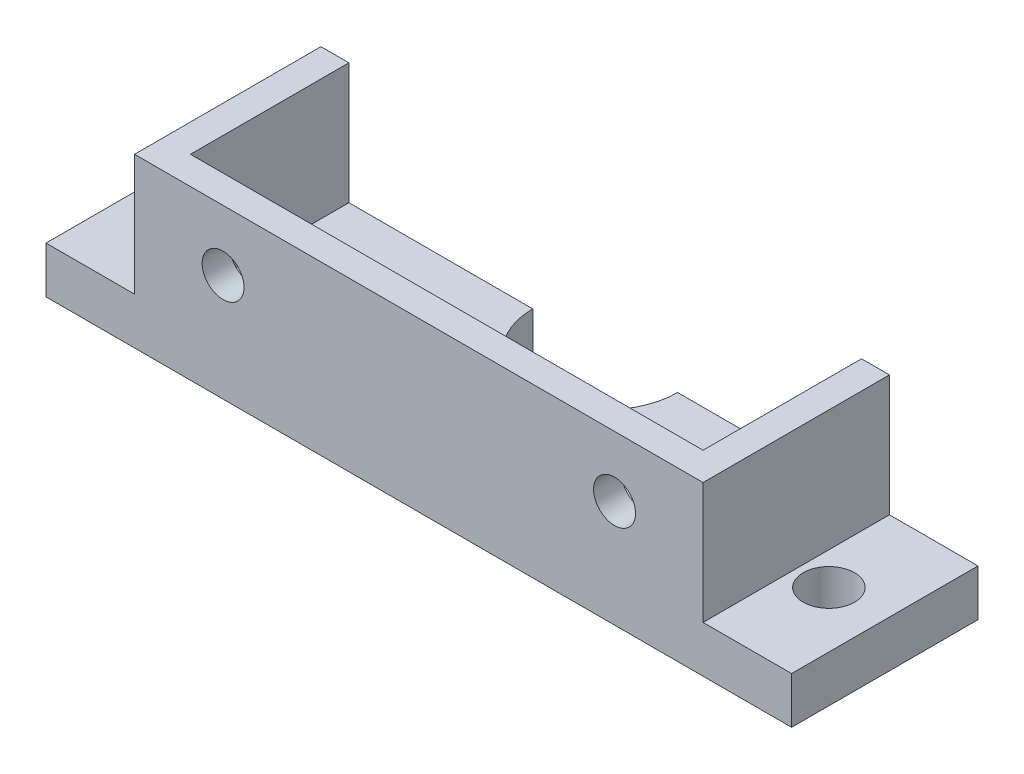
ISO-10303-21;
HEADER;
FILE_DESCRIPTION(('STEP AP214'),'2;1');
FILE_NAME('part.step','',(''),(''),'','','');
FILE_SCHEMA(('AUTOMOTIVE_DESIGN { 1 0 10303 214 1 1 1 1 }'));
ENDSEC;
DATA;
#1=APPLICATION_CONTEXT('core data for automotive mechanical design processes');
#2=APPLICATION_PROTOCOL_DEFINITION('international standard','automotive_design',2000,#1);
#3=PRODUCT_CONTEXT('',#1,'mechanical');
#4=PRODUCT('Part','Part','',(#3));
#5=PRODUCT_RELATED_PRODUCT_CATEGORY('part','',(#4));
#6=PRODUCT_DEFINITION_FORMATION('','',#4);
#7=PRODUCT_DEFINITION_CONTEXT('part definition',#1,'design');
#8=PRODUCT_DEFINITION('design','',#6,#7);
#9=PRODUCT_DEFINITION_SHAPE('','',#8);
#10=(LENGTH_UNIT() NAMED_UNIT(*) SI_UNIT(.MILLI.,.METRE.));
#11=(NAMED_UNIT(*) PLANE_ANGLE_UNIT() SI_UNIT($,.RADIAN.));
#12=(NAMED_UNIT(*) SI_UNIT($,.STERADIAN.) SOLID_ANGLE_UNIT());
#13=UNCERTAINTY_MEASURE_WITH_UNIT(LENGTH_MEASURE(1.E-05),#10,'distance_accuracy_value','');
#14=(GEOMETRIC_REPRESENTATION_CONTEXT(3) GLOBAL_UNCERTAINTY_ASSIGNED_CONTEXT((#13)) GLOBAL_UNIT_ASSIGNED_CONTEXT((#10,
#11,#12)) REPRESENTATION_CONTEXT('',''));
#15=CARTESIAN_POINT('',(0.,0.,0.));
#16=DIRECTION('',(0.,0.,1.));
#17=DIRECTION('',(1.,0.,0.));
#18=AXIS2_PLACEMENT_3D('',#15,#16,#17);
#19=CARTESIAN_POINT('',(-40.,5.,-10.));
#20=DIRECTION('',(0.,0.,1.));
#21=DIRECTION('',(1.,0.,0.));
#22=AXIS2_PLACEMENT_3D('',#19,#20,#21);
#23=PLANE('',#22);
#24=DIRECTION('',(-1.,0.,0.));
#25=VECTOR('',#24,1.);
#26=CARTESIAN_POINT('',(-40.,0.,-10.));
#27=LINE('',#26,#25);
#28=CARTESIAN_POINT('',(40.,0.,-10.));
#29=VERTEX_POINT('',#28);
#30=CARTESIAN_POINT('',(7.77128440844158,0.,-10.));
#31=VERTEX_POINT('',#30);
#32=EDGE_CURVE('E146',#29,#31,#27,.T.);
#33=ORIENTED_EDGE('',*,*,#32,.T.);
#34=DIRECTION('',(0.,1.,0.));
#35=VECTOR('',#34,1.);
#36=CARTESIAN_POINT('',(7.77128440844158,-12.,-10.));
#37=LINE('',#36,#35);
#38=CARTESIAN_POINT('',(7.77128440844158,5.,-10.));
#39=VERTEX_POINT('',#38);
#40=EDGE_CURVE('E48',#31,#39,#37,.T.);
#41=ORIENTED_EDGE('',*,*,#40,.T.);
#42=DIRECTION('',(-1.,0.,0.));
#43=VECTOR('',#42,1.);
#44=CARTESIAN_POINT('',(-40.,5.,-10.));
#45=LINE('',#44,#43);
#46=CARTESIAN_POINT('',(27.5,5.,-10.));
#47=VERTEX_POINT('',#46);
#48=EDGE_CURVE('E144',#47,#39,#45,.T.);
#49=ORIENTED_EDGE('',*,*,#48,.F.);
#50=DIRECTION('',(0.,1.,0.));
#51=VECTOR('',#50,1.);
#52=CARTESIAN_POINT('',(27.5,18.,-10.));
#53=LINE('',#52,#51);
#54=CARTESIAN_POINT('',(27.5,18.,-10.));
#55=VERTEX_POINT('',#54);
#56=EDGE_CURVE('E229',#47,#55,#53,.T.);
#57=ORIENTED_EDGE('',*,*,#56,.T.);
#58=DIRECTION('',(1.,0.,0.));
#59=VECTOR('',#58,1.);
#60=CARTESIAN_POINT('',(30.5,18.,-10.));
#61=LINE('',#60,#59);
#62=CARTESIAN_POINT('',(30.5,18.,-10.));
#63=VERTEX_POINT('',#62);
#64=EDGE_CURVE('E222',#55,#63,#61,.T.);
#65=ORIENTED_EDGE('',*,*,#64,.T.);
#66=DIRECTION('',(0.,-1.,0.));
#67=VECTOR('',#66,1.);
#68=CARTESIAN_POINT('',(30.5,18.,-10.));
#69=LINE('',#68,#67);
#70=CARTESIAN_POINT('',(30.5,5.,-10.));
#71=VERTEX_POINT('',#70);
#72=EDGE_CURVE('E225',#63,#71,#69,.T.);
#73=ORIENTED_EDGE('',*,*,#72,.T.);
#74=CARTESIAN_POINT('',(40.,5.,-10.));
#75=VERTEX_POINT('',#74);
#76=EDGE_CURVE('E153',#75,#71,#45,.T.);
#77=ORIENTED_EDGE('',*,*,#76,.F.);
#78=DIRECTION('',(0.,-1.,0.));
#79=VECTOR('',#78,1.);
#80=CARTESIAN_POINT('',(40.,5.,-10.));
#81=LINE('',#80,#79);
#82=EDGE_CURVE('E41',#75,#29,#81,.T.);
#83=ORIENTED_EDGE('',*,*,#82,.T.);
#84=EDGE_LOOP('',(#33,#41,#49,#57,#65,#73,#77,#83));
#85=FACE_BOUND('',#84,.T.);
#86=ADVANCED_FACE('F33',(#85),#23,.F.);
#87=CARTESIAN_POINT('',(0.,5.,0.));
#88=DIRECTION('',(0.,1.,0.));
#89=DIRECTION('',(0.,0.,1.));
#90=AXIS2_PLACEMENT_3D('',#87,#88,#89);
#91=PLANE('',#90);
#92=CARTESIAN_POINT('',(-34.,5.,0.));
#93=DIRECTION('',(0.,1.,0.));
#94=DIRECTION('',(0.,0.,1.));
#95=AXIS2_PLACEMENT_3D('',#92,#93,#94);
#96=CIRCLE('',#95,2.74999999999999);
#97=CARTESIAN_POINT('',(-34.,5.,2.74999999999999));
#98=VERTEX_POINT('',#97);
#99=EDGE_CURVE('E173',#98,#98,#96,.T.);
#100=ORIENTED_EDGE('',*,*,#99,.F.);
#101=EDGE_LOOP('',(#100));
#102=FACE_BOUND('',#101,.T.);
#103=DIRECTION('',(0.,0.,1.));
#104=VECTOR('',#103,1.);
#105=CARTESIAN_POINT('',(-30.5,5.,7.));
#106=LINE('',#105,#104);
#107=CARTESIAN_POINT('',(-30.5,5.,-10.));
#108=VERTEX_POINT('',#107);
#109=CARTESIAN_POINT('',(-30.5,5.,10.));
#110=VERTEX_POINT('',#109);
#111=EDGE_CURVE('E192',#108,#110,#106,.T.);
#112=ORIENTED_EDGE('',*,*,#111,.F.);
#113=CARTESIAN_POINT('',(-40.,5.,-10.));
#114=VERTEX_POINT('',#113);
#115=EDGE_CURVE('E156',#108,#114,#45,.T.);
#116=ORIENTED_EDGE('',*,*,#115,.T.);
#117=DIRECTION('',(0.,0.,1.));
#118=VECTOR('',#117,1.);
#119=CARTESIAN_POINT('',(-40.,5.,-10.));
#120=LINE('',#119,#118);
#121=CARTESIAN_POINT('',(-40.,5.,10.));
#122=VERTEX_POINT('',#121);
#123=EDGE_CURVE('E158',#114,#122,#120,.T.);
#124=ORIENTED_EDGE('',*,*,#123,.T.);
#125=DIRECTION('',(1.,0.,0.));
#126=VECTOR('',#125,1.);
#127=CARTESIAN_POINT('',(-40.,5.,10.));
#128=LINE('',#127,#126);
#129=EDGE_CURVE('E265',#122,#110,#128,.T.);
#130=ORIENTED_EDGE('',*,*,#129,.T.);
#131=EDGE_LOOP('',(#112,#116,#124,#130));
#132=FACE_BOUND('',#131,.T.);
#133=ADVANCED_FACE('F307',(#102,#132),#91,.T.);
#134=CARTESIAN_POINT('',(0.,5.,-10.));
#135=DIRECTION('',(0.,1.,0.));
#136=DIRECTION('',(0.,0.,1.));
#137=AXIS2_PLACEMENT_3D('',#134,#135,#136);
#138=CIRCLE('',#137,7.77128440844159);
#139=CARTESIAN_POINT('',(-7.7712844084416,5.,-10.));
#140=VERTEX_POINT('',#139);
#141=EDGE_CURVE('E133',#140,#39,#138,.T.);
#142=ORIENTED_EDGE('',*,*,#141,.F.);
#143=CARTESIAN_POINT('',(-27.5,5.,-10.));
#144=VERTEX_POINT('',#143);
#145=EDGE_CURVE('E154',#140,#144,#45,.T.);
#146=ORIENTED_EDGE('',*,*,#145,.T.);
#147=DIRECTION('',(0.,0.,1.));
#148=VECTOR('',#147,1.);
#149=CARTESIAN_POINT('',(-27.5,5.,-10.));
#150=LINE('',#149,#148);
#151=CARTESIAN_POINT('',(-27.5,5.,7.));
#152=VERTEX_POINT('',#151);
#153=EDGE_CURVE('E234',#144,#152,#150,.T.);
#154=ORIENTED_EDGE('',*,*,#153,.T.);
#155=DIRECTION('',(1.,0.,0.));
#156=VECTOR('',#155,1.);
#157=CARTESIAN_POINT('',(-30.5,5.,7.));
#158=LINE('',#157,#156);
#159=CARTESIAN_POINT('',(27.5,5.,7.));
#160=VERTEX_POINT('',#159);
#161=EDGE_CURVE('E190',#152,#160,#158,.T.);
#162=ORIENTED_EDGE('',*,*,#161,.T.);
#163=DIRECTION('',(0.,0.,1.));
#164=VECTOR('',#163,1.);
#165=CARTESIAN_POINT('',(27.5,5.,-10.));
#166=LINE('',#165,#164);
#167=EDGE_CURVE('E152',#47,#160,#166,.T.);
#168=ORIENTED_EDGE('',*,*,#167,.F.);
#169=ORIENTED_EDGE('',*,*,#48,.T.);
#170=EDGE_LOOP('',(#142,#146,#154,#162,#168,#169));
#171=FACE_BOUND('',#170,.T.);
#172=ADVANCED_FACE('F150',(#171),#91,.T.);
#173=CARTESIAN_POINT('',(0.,0.,7.));
#174=DIRECTION('',(0.,0.,1.));
#175=DIRECTION('',(1.,0.,0.));
#176=AXIS2_PLACEMENT_3D('',#173,#174,#175);
#177=PLANE('',#176);
#178=CARTESIAN_POINT('',(21.,11.5,7.));
#179=DIRECTION('',(0.,0.,1.));
#180=DIRECTION('',(1.,0.,0.));
#181=AXIS2_PLACEMENT_3D('',#178,#179,#180);
#182=CIRCLE('',#181,2.25);
#183=CARTESIAN_POINT('',(23.25,11.5,7.));
#184=VERTEX_POINT('',#183);
#185=EDGE_CURVE('E212',#184,#184,#182,.T.);
#186=ORIENTED_EDGE('',*,*,#185,.T.);
#187=EDGE_LOOP('',(#186));
#188=FACE_BOUND('',#187,.T.);
#189=CARTESIAN_POINT('',(-21.,11.5,7.));
#190=DIRECTION('',(0.,0.,1.));
#191=DIRECTION('',(1.,0.,0.));
#192=AXIS2_PLACEMENT_3D('',#189,#190,#191);
#193=CIRCLE('',#192,2.25);
#194=CARTESIAN_POINT('',(-18.75,11.5,7.));
#195=VERTEX_POINT('',#194);
#196=EDGE_CURVE('E206',#195,#195,#193,.T.);
#197=ORIENTED_EDGE('',*,*,#196,.T.);
#198=EDGE_LOOP('',(#197));
#199=FACE_BOUND('',#198,.T.);
#200=DIRECTION('',(0.,-1.,0.));
#201=VECTOR('',#200,1.);
#202=CARTESIAN_POINT('',(-27.5,18.,7.));
#203=LINE('',#202,#201);
#204=CARTESIAN_POINT('',(-27.5,18.,7.));
#205=VERTEX_POINT('',#204);
#206=EDGE_CURVE('E147',#205,#152,#203,.T.);
#207=ORIENTED_EDGE('',*,*,#206,.F.);
#208=DIRECTION('',(-1.,0.,0.));
#209=VECTOR('',#208,1.);
#210=CARTESIAN_POINT('',(-30.5,18.,7.));
#211=LINE('',#210,#209);
#212=CARTESIAN_POINT('',(27.5,18.,7.));
#213=VERTEX_POINT('',#212);
#214=EDGE_CURVE('E199',#213,#205,#211,.T.);
#215=ORIENTED_EDGE('',*,*,#214,.F.);
#216=DIRECTION('',(0.,1.,0.));
#217=VECTOR('',#216,1.);
#218=CARTESIAN_POINT('',(27.5,18.,7.));
#219=LINE('',#218,#217);
#220=EDGE_CURVE('E223',#160,#213,#219,.T.);
#221=ORIENTED_EDGE('',*,*,#220,.F.);
#222=ORIENTED_EDGE('',*,*,#161,.F.);
#223=EDGE_LOOP('',(#207,#215,#221,#222));
#224=FACE_BOUND('',#223,.T.);
#225=ADVANCED_FACE('F299',(#188,#199,#224),#177,.F.);
#226=CARTESIAN_POINT('',(34.,5.,0.));
#227=DIRECTION('',(0.,1.,0.));
#228=DIRECTION('',(0.,0.,1.));
#229=AXIS2_PLACEMENT_3D('',#226,#227,#228);
#230=CIRCLE('',#229,2.75);
#231=CARTESIAN_POINT('',(34.,5.,2.75));
#232=VERTEX_POINT('',#231);
#233=EDGE_CURVE('E181',#232,#232,#230,.T.);
#234=ORIENTED_EDGE('',*,*,#233,.F.);
#235=EDGE_LOOP('',(#234));
#236=FACE_BOUND('',#235,.T.);
#237=ORIENTED_EDGE('',*,*,#76,.T.);
#238=DIRECTION('',(0.,0.,1.));
#239=VECTOR('',#238,1.);
#240=CARTESIAN_POINT('',(30.5,5.,7.));
#241=LINE('',#240,#239);
#242=CARTESIAN_POINT('',(30.5,5.,10.));
#243=VERTEX_POINT('',#242);
#244=EDGE_CURVE('E184',#71,#243,#241,.T.);
#245=ORIENTED_EDGE('',*,*,#244,.T.);
#246=CARTESIAN_POINT('',(40.,5.,10.));
#247=VERTEX_POINT('',#246);
#248=EDGE_CURVE('E306',#243,#247,#128,.T.);
#249=ORIENTED_EDGE('',*,*,#248,.T.);
#250=DIRECTION('',(0.,0.,-1.));
#251=VECTOR('',#250,1.);
#252=CARTESIAN_POINT('',(40.,5.,-10.));
#253=LINE('',#252,#251);
#254=EDGE_CURVE('E161',#247,#75,#253,.T.);
#255=ORIENTED_EDGE('',*,*,#254,.T.);
#256=EDGE_LOOP('',(#237,#245,#249,#255));
#257=FACE_BOUND('',#256,.T.);
#258=ADVANCED_FACE('F305',(#236,#257),#91,.T.);
#259=CARTESIAN_POINT('',(40.,5.,-10.));
#260=DIRECTION('',(-1.,0.,0.));
#261=DIRECTION('',(0.,0.,1.));
#262=AXIS2_PLACEMENT_3D('',#259,#260,#261);
#263=PLANE('',#262);
#264=DIRECTION('',(0.,0.,-1.));
#265=VECTOR('',#264,1.);
#266=CARTESIAN_POINT('',(40.,0.,-10.));
#267=LINE('',#266,#265);
#268=CARTESIAN_POINT('',(40.,0.,10.));
#269=VERTEX_POINT('',#268);
#270=EDGE_CURVE('E180',#269,#29,#267,.T.);
#271=ORIENTED_EDGE('',*,*,#270,.T.);
#272=ORIENTED_EDGE('',*,*,#82,.F.);
#273=ORIENTED_EDGE('',*,*,#254,.F.);
#274=DIRECTION('',(0.,-1.,0.));
#275=VECTOR('',#274,1.);
#276=CARTESIAN_POINT('',(40.,5.,10.));
#277=LINE('',#276,#275);
#278=EDGE_CURVE('E261',#247,#269,#277,.T.);
#279=ORIENTED_EDGE('',*,*,#278,.T.);
#280=EDGE_LOOP('',(#271,#272,#273,#279));
#281=FACE_BOUND('',#280,.T.);
#282=ADVANCED_FACE('F35',(#281),#263,.F.);
#283=ORIENTED_EDGE('',*,*,#145,.F.);
#284=DIRECTION('',(0.,1.,0.));
#285=VECTOR('',#284,1.);
#286=CARTESIAN_POINT('',(-7.7712844084416,-12.,-10.));
#287=LINE('',#286,#285);
#288=CARTESIAN_POINT('',(-7.7712844084416,0.,-10.));
#289=VERTEX_POINT('',#288);
#290=EDGE_CURVE('E136',#140,#289,#287,.F.);
#291=ORIENTED_EDGE('',*,*,#290,.T.);
#292=CARTESIAN_POINT('',(-40.,0.,-10.));
#293=VERTEX_POINT('',#292);
#294=EDGE_CURVE('E249',#289,#293,#27,.T.);
#295=ORIENTED_EDGE('',*,*,#294,.T.);
#296=DIRECTION('',(0.,-1.,0.));
#297=VECTOR('',#296,1.);
#298=CARTESIAN_POINT('',(-40.,5.,-10.));
#299=LINE('',#298,#297);
#300=EDGE_CURVE('E268',#114,#293,#299,.T.);
#301=ORIENTED_EDGE('',*,*,#300,.F.);
#302=ORIENTED_EDGE('',*,*,#115,.F.);
#303=DIRECTION('',(0.,1.,0.));
#304=VECTOR('',#303,1.);
#305=CARTESIAN_POINT('',(-30.5,18.,-10.));
#306=LINE('',#305,#304);
#307=CARTESIAN_POINT('',(-30.5,18.,-10.));
#308=VERTEX_POINT('',#307);
#309=EDGE_CURVE('E239',#108,#308,#306,.T.);
#310=ORIENTED_EDGE('',*,*,#309,.T.);
#311=DIRECTION('',(1.,0.,0.));
#312=VECTOR('',#311,1.);
#313=CARTESIAN_POINT('',(-30.5,18.,-10.));
#314=LINE('',#313,#312);
#315=CARTESIAN_POINT('',(-27.5,18.,-10.));
#316=VERTEX_POINT('',#315);
#317=EDGE_CURVE('E242',#308,#316,#314,.T.);
#318=ORIENTED_EDGE('',*,*,#317,.T.);
#319=DIRECTION('',(0.,-1.,0.));
#320=VECTOR('',#319,1.);
#321=CARTESIAN_POINT('',(-27.5,18.,-10.));
#322=LINE('',#321,#320);
#323=EDGE_CURVE('E237',#316,#144,#322,.T.);
#324=ORIENTED_EDGE('',*,*,#323,.T.);
#325=EDGE_LOOP('',(#283,#291,#295,#301,#302,#310,#318,#324));
#326=FACE_BOUND('',#325,.T.);
#327=ADVANCED_FACE('F248',(#326),#23,.F.);
#328=CARTESIAN_POINT('',(-40.,5.,-10.));
#329=DIRECTION('',(1.,0.,0.));
#330=DIRECTION('',(0.,0.,-1.));
#331=AXIS2_PLACEMENT_3D('',#328,#329,#330);
#332=PLANE('',#331);
#333=DIRECTION('',(0.,0.,1.));
#334=VECTOR('',#333,1.);
#335=CARTESIAN_POINT('',(-40.,0.,-10.));
#336=LINE('',#335,#334);
#337=CARTESIAN_POINT('',(-40.,0.,10.));
#338=VERTEX_POINT('',#337);
#339=EDGE_CURVE('E170',#293,#338,#336,.T.);
#340=ORIENTED_EDGE('',*,*,#339,.T.);
#341=DIRECTION('',(0.,-1.,0.));
#342=VECTOR('',#341,1.);
#343=CARTESIAN_POINT('',(-40.,5.,10.));
#344=LINE('',#343,#342);
#345=EDGE_CURVE('E264',#122,#338,#344,.T.);
#346=ORIENTED_EDGE('',*,*,#345,.F.);
#347=ORIENTED_EDGE('',*,*,#123,.F.);
#348=ORIENTED_EDGE('',*,*,#300,.T.);
#349=EDGE_LOOP('',(#340,#346,#347,#348));
#350=FACE_BOUND('',#349,.T.);
#351=ADVANCED_FACE('F281',(#350),#332,.F.);
#352=CARTESIAN_POINT('',(-40.,5.,10.));
#353=DIRECTION('',(0.,0.,-1.));
#354=DIRECTION('',(-1.,0.,0.));
#355=AXIS2_PLACEMENT_3D('',#352,#353,#354);
#356=PLANE('',#355);
#357=DIRECTION('',(1.,0.,0.));
#358=VECTOR('',#357,1.);
#359=CARTESIAN_POINT('',(-40.,0.,10.));
#360=LINE('',#359,#358);
#361=EDGE_CURVE('E166',#338,#269,#360,.T.);
#362=ORIENTED_EDGE('',*,*,#361,.T.);
#363=ORIENTED_EDGE('',*,*,#278,.F.);
#364=ORIENTED_EDGE('',*,*,#248,.F.);
#365=DIRECTION('',(0.,1.,0.));
#366=VECTOR('',#365,1.);
#367=CARTESIAN_POINT('',(30.5,18.,10.));
#368=LINE('',#367,#366);
#369=CARTESIAN_POINT('',(30.5,18.,10.));
#370=VERTEX_POINT('',#369);
#371=EDGE_CURVE('E203',#243,#370,#368,.T.);
#372=ORIENTED_EDGE('',*,*,#371,.T.);
#373=DIRECTION('',(-1.,0.,0.));
#374=VECTOR('',#373,1.);
#375=CARTESIAN_POINT('',(-30.5,18.,10.));
#376=LINE('',#375,#374);
#377=CARTESIAN_POINT('',(-30.5,18.,10.));
#378=VERTEX_POINT('',#377);
#379=EDGE_CURVE('E200',#370,#378,#376,.T.);
#380=ORIENTED_EDGE('',*,*,#379,.T.);
#381=DIRECTION('',(0.,-1.,0.));
#382=VECTOR('',#381,1.);
#383=CARTESIAN_POINT('',(-30.5,18.,10.));
#384=LINE('',#383,#382);
#385=EDGE_CURVE('E196',#378,#110,#384,.T.);
#386=ORIENTED_EDGE('',*,*,#385,.T.);
#387=ORIENTED_EDGE('',*,*,#129,.F.);
#388=ORIENTED_EDGE('',*,*,#345,.T.);
#389=EDGE_LOOP('',(#362,#363,#364,#372,#380,#386,#387,#388));
#390=FACE_BOUND('',#389,.T.);
#391=CARTESIAN_POINT('',(21.,11.5,10.));
#392=DIRECTION('',(0.,0.,1.));
#393=DIRECTION('',(1.,0.,0.));
#394=AXIS2_PLACEMENT_3D('',#391,#392,#393);
#395=CIRCLE('',#394,2.25);
#396=CARTESIAN_POINT('',(23.25,11.5,10.));
#397=VERTEX_POINT('',#396);
#398=EDGE_CURVE('E215',#397,#397,#395,.T.);
#399=ORIENTED_EDGE('',*,*,#398,.F.);
#400=EDGE_LOOP('',(#399));
#401=FACE_BOUND('',#400,.T.);
#402=CARTESIAN_POINT('',(-21.,11.5,10.));
#403=DIRECTION('',(0.,0.,1.));
#404=DIRECTION('',(1.,0.,0.));
#405=AXIS2_PLACEMENT_3D('',#402,#403,#404);
#406=CIRCLE('',#405,2.25);
#407=CARTESIAN_POINT('',(-18.75,11.5,10.));
#408=VERTEX_POINT('',#407);
#409=EDGE_CURVE('E209',#408,#408,#406,.T.);
#410=ORIENTED_EDGE('',*,*,#409,.F.);
#411=EDGE_LOOP('',(#410));
#412=FACE_BOUND('',#411,.T.);
#413=ADVANCED_FACE('F273',(#390,#401,#412),#356,.F.);
#414=CARTESIAN_POINT('',(0.,0.,0.));
#415=DIRECTION('',(0.,1.,0.));
#416=DIRECTION('',(0.,0.,1.));
#417=AXIS2_PLACEMENT_3D('',#414,#415,#416);
#418=PLANE('',#417);
#419=CARTESIAN_POINT('',(34.,0.,0.));
#420=DIRECTION('',(0.,1.,0.));
#421=DIRECTION('',(0.,0.,1.));
#422=AXIS2_PLACEMENT_3D('',#419,#420,#421);
#423=CIRCLE('',#422,2.75);
#424=CARTESIAN_POINT('',(34.,0.,2.75));
#425=VERTEX_POINT('',#424);
#426=EDGE_CURVE('E177',#425,#425,#423,.T.);
#427=ORIENTED_EDGE('',*,*,#426,.T.);
#428=EDGE_LOOP('',(#427));
#429=FACE_BOUND('',#428,.T.);
#430=CARTESIAN_POINT('',(-34.,0.,0.));
#431=DIRECTION('',(0.,1.,0.));
#432=DIRECTION('',(0.,0.,1.));
#433=AXIS2_PLACEMENT_3D('',#430,#431,#432);
#434=CIRCLE('',#433,2.74999999999999);
#435=CARTESIAN_POINT('',(-34.,0.,2.74999999999999));
#436=VERTEX_POINT('',#435);
#437=EDGE_CURVE('E176',#436,#436,#434,.T.);
#438=ORIENTED_EDGE('',*,*,#437,.T.);
#439=EDGE_LOOP('',(#438));
#440=FACE_BOUND('',#439,.T.);
#441=ORIENTED_EDGE('',*,*,#294,.F.);
#442=CARTESIAN_POINT('',(0.,0.,-10.));
#443=DIRECTION('',(0.,1.,0.));
#444=DIRECTION('',(0.,0.,1.));
#445=AXIS2_PLACEMENT_3D('',#442,#443,#444);
#446=CIRCLE('',#445,7.77128440844159);
#447=EDGE_CURVE('E11',#289,#31,#446,.T.);
#448=ORIENTED_EDGE('',*,*,#447,.T.);
#449=ORIENTED_EDGE('',*,*,#32,.F.);
#450=ORIENTED_EDGE('',*,*,#270,.F.);
#451=ORIENTED_EDGE('',*,*,#361,.F.);
#452=ORIENTED_EDGE('',*,*,#339,.F.);
#453=EDGE_LOOP('',(#441,#448,#449,#450,#451,#452));
#454=FACE_BOUND('',#453,.T.);
#455=ADVANCED_FACE('F253',(#429,#440,#454),#418,.F.);
#456=CARTESIAN_POINT('',(-34.,0.,0.));
#457=DIRECTION('',(0.,1.,0.));
#458=DIRECTION('',(0.,0.,1.));
#459=AXIS2_PLACEMENT_3D('',#456,#457,#458);
#460=CYLINDRICAL_SURFACE('',#459,2.74999999999999);
#461=ORIENTED_EDGE('',*,*,#437,.F.);
#462=EDGE_LOOP('',(#461));
#463=FACE_BOUND('',#462,.T.);
#464=ORIENTED_EDGE('',*,*,#99,.T.);
#465=EDGE_LOOP('',(#464));
#466=FACE_BOUND('',#465,.T.);
#467=ADVANCED_FACE('F330',(#463,#466),#460,.F.);
#468=CARTESIAN_POINT('',(34.,0.,0.));
#469=DIRECTION('',(0.,1.,0.));
#470=DIRECTION('',(0.,0.,1.));
#471=AXIS2_PLACEMENT_3D('',#468,#469,#470);
#472=CYLINDRICAL_SURFACE('',#471,2.75);
#473=ORIENTED_EDGE('',*,*,#426,.F.);
#474=EDGE_LOOP('',(#473));
#475=FACE_BOUND('',#474,.T.);
#476=ORIENTED_EDGE('',*,*,#233,.T.);
#477=EDGE_LOOP('',(#476));
#478=FACE_BOUND('',#477,.T.);
#479=ADVANCED_FACE('F328',(#475,#478),#472,.F.);
#480=CARTESIAN_POINT('',(30.5,18.,7.));
#481=DIRECTION('',(1.,0.,0.));
#482=DIRECTION('',(0.,0.,-1.));
#483=AXIS2_PLACEMENT_3D('',#480,#481,#482);
#484=PLANE('',#483);
#485=ORIENTED_EDGE('',*,*,#371,.F.);
#486=ORIENTED_EDGE('',*,*,#244,.F.);
#487=ORIENTED_EDGE('',*,*,#72,.F.);
#488=DIRECTION('',(0.,0.,1.));
#489=VECTOR('',#488,1.);
#490=CARTESIAN_POINT('',(30.5,18.,7.));
#491=LINE('',#490,#489);
#492=EDGE_CURVE('E187',#63,#370,#491,.T.);
#493=ORIENTED_EDGE('',*,*,#492,.T.);
#494=EDGE_LOOP('',(#485,#486,#487,#493));
#495=FACE_BOUND('',#494,.T.);
#496=ADVANCED_FACE('F304',(#495),#484,.T.);
#497=CARTESIAN_POINT('',(-30.5,18.,7.));
#498=DIRECTION('',(-1.,0.,0.));
#499=DIRECTION('',(0.,-1.,0.));
#500=AXIS2_PLACEMENT_3D('',#497,#498,#499);
#501=PLANE('',#500);
#502=ORIENTED_EDGE('',*,*,#385,.F.);
#503=DIRECTION('',(0.,0.,1.));
#504=VECTOR('',#503,1.);
#505=CARTESIAN_POINT('',(-30.5,18.,7.));
#506=LINE('',#505,#504);
#507=EDGE_CURVE('E189',#308,#378,#506,.T.);
#508=ORIENTED_EDGE('',*,*,#507,.F.);
#509=ORIENTED_EDGE('',*,*,#309,.F.);
#510=ORIENTED_EDGE('',*,*,#111,.T.);
#511=EDGE_LOOP('',(#502,#508,#509,#510));
#512=FACE_BOUND('',#511,.T.);
#513=ADVANCED_FACE('F287',(#512),#501,.T.);
#514=CARTESIAN_POINT('',(-30.5,18.,7.));
#515=DIRECTION('',(0.,1.,0.));
#516=DIRECTION('',(0.,0.,1.));
#517=AXIS2_PLACEMENT_3D('',#514,#515,#516);
#518=PLANE('',#517);
#519=ORIENTED_EDGE('',*,*,#379,.F.);
#520=ORIENTED_EDGE('',*,*,#492,.F.);
#521=ORIENTED_EDGE('',*,*,#64,.F.);
#522=DIRECTION('',(0.,0.,1.));
#523=VECTOR('',#522,1.);
#524=CARTESIAN_POINT('',(27.5,18.,-10.));
#525=LINE('',#524,#523);
#526=EDGE_CURVE('E55',#55,#213,#525,.T.);
#527=ORIENTED_EDGE('',*,*,#526,.T.);
#528=ORIENTED_EDGE('',*,*,#214,.T.);
#529=DIRECTION('',(0.,0.,1.));
#530=VECTOR('',#529,1.);
#531=CARTESIAN_POINT('',(-27.5,18.,-10.));
#532=LINE('',#531,#530);
#533=EDGE_CURVE('E226',#316,#205,#532,.T.);
#534=ORIENTED_EDGE('',*,*,#533,.F.);
#535=ORIENTED_EDGE('',*,*,#317,.F.);
#536=ORIENTED_EDGE('',*,*,#507,.T.);
#537=EDGE_LOOP('',(#519,#520,#521,#527,#528,#534,#535,#536));
#538=FACE_BOUND('',#537,.T.);
#539=ADVANCED_FACE('F289',(#538),#518,.T.);
#540=CARTESIAN_POINT('',(-21.,11.5,7.));
#541=DIRECTION('',(0.,0.,1.));
#542=DIRECTION('',(1.,0.,0.));
#543=AXIS2_PLACEMENT_3D('',#540,#541,#542);
#544=CYLINDRICAL_SURFACE('',#543,2.25);
#545=ORIENTED_EDGE('',*,*,#196,.F.);
#546=EDGE_LOOP('',(#545));
#547=FACE_BOUND('',#546,.T.);
#548=ORIENTED_EDGE('',*,*,#409,.T.);
#549=EDGE_LOOP('',(#548));
#550=FACE_BOUND('',#549,.T.);
#551=ADVANCED_FACE('F343',(#547,#550),#544,.F.);
#552=CARTESIAN_POINT('',(21.,11.5,7.));
#553=DIRECTION('',(0.,0.,1.));
#554=DIRECTION('',(1.,0.,0.));
#555=AXIS2_PLACEMENT_3D('',#552,#553,#554);
#556=CYLINDRICAL_SURFACE('',#555,2.25);
#557=ORIENTED_EDGE('',*,*,#185,.F.);
#558=EDGE_LOOP('',(#557));
#559=FACE_BOUND('',#558,.T.);
#560=ORIENTED_EDGE('',*,*,#398,.T.);
#561=EDGE_LOOP('',(#560));
#562=FACE_BOUND('',#561,.T.);
#563=ADVANCED_FACE('F348',(#559,#562),#556,.F.);
#564=CARTESIAN_POINT('',(27.5,18.,-10.));
#565=DIRECTION('',(1.,0.,0.));
#566=DIRECTION('',(0.,1.,0.));
#567=AXIS2_PLACEMENT_3D('',#564,#565,#566);
#568=PLANE('',#567);
#569=ORIENTED_EDGE('',*,*,#220,.T.);
#570=ORIENTED_EDGE('',*,*,#526,.F.);
#571=ORIENTED_EDGE('',*,*,#56,.F.);
#572=ORIENTED_EDGE('',*,*,#167,.T.);
#573=EDGE_LOOP('',(#569,#570,#571,#572));
#574=FACE_BOUND('',#573,.T.);
#575=ADVANCED_FACE('F301',(#574),#568,.F.);
#576=CARTESIAN_POINT('',(-27.5,18.,-10.));
#577=DIRECTION('',(-1.,0.,0.));
#578=DIRECTION('',(0.,-1.,0.));
#579=AXIS2_PLACEMENT_3D('',#576,#577,#578);
#580=PLANE('',#579);
#581=ORIENTED_EDGE('',*,*,#206,.T.);
#582=ORIENTED_EDGE('',*,*,#153,.F.);
#583=ORIENTED_EDGE('',*,*,#323,.F.);
#584=ORIENTED_EDGE('',*,*,#533,.T.);
#585=EDGE_LOOP('',(#581,#582,#583,#584));
#586=FACE_BOUND('',#585,.T.);
#587=ADVANCED_FACE('F295',(#586),#580,.F.);
#588=CARTESIAN_POINT('',(0.,-12.,-10.));
#589=DIRECTION('',(0.,1.,0.));
#590=DIRECTION('',(0.,0.,1.));
#591=AXIS2_PLACEMENT_3D('',#588,#589,#590);
#592=CYLINDRICAL_SURFACE('',#591,7.77128440844159);
#593=ORIENTED_EDGE('',*,*,#447,.F.);
#594=ORIENTED_EDGE('',*,*,#290,.F.);
#595=ORIENTED_EDGE('',*,*,#141,.T.);
#596=ORIENTED_EDGE('',*,*,#40,.F.);
#597=EDGE_LOOP('',(#593,#594,#595,#596));
#598=FACE_BOUND('',#597,.T.);
#599=ADVANCED_FACE('F134',(#598),#592,.F.);
#600=CLOSED_SHELL('',(#86,#133,#172,#225,#258,#282,#327,#351,#413,#455,#467,#479,#496,#513,#539,
#551,#563,#575,#587,#599));
#601=MANIFOLD_SOLID_BREP('B2',#600);
#602=ADVANCED_BREP_SHAPE_REPRESENTATION('',(#18,#601),#14);
#603=SHAPE_DEFINITION_REPRESENTATION(#9,#602);
ENDSEC;
END-ISO-10303-21;
